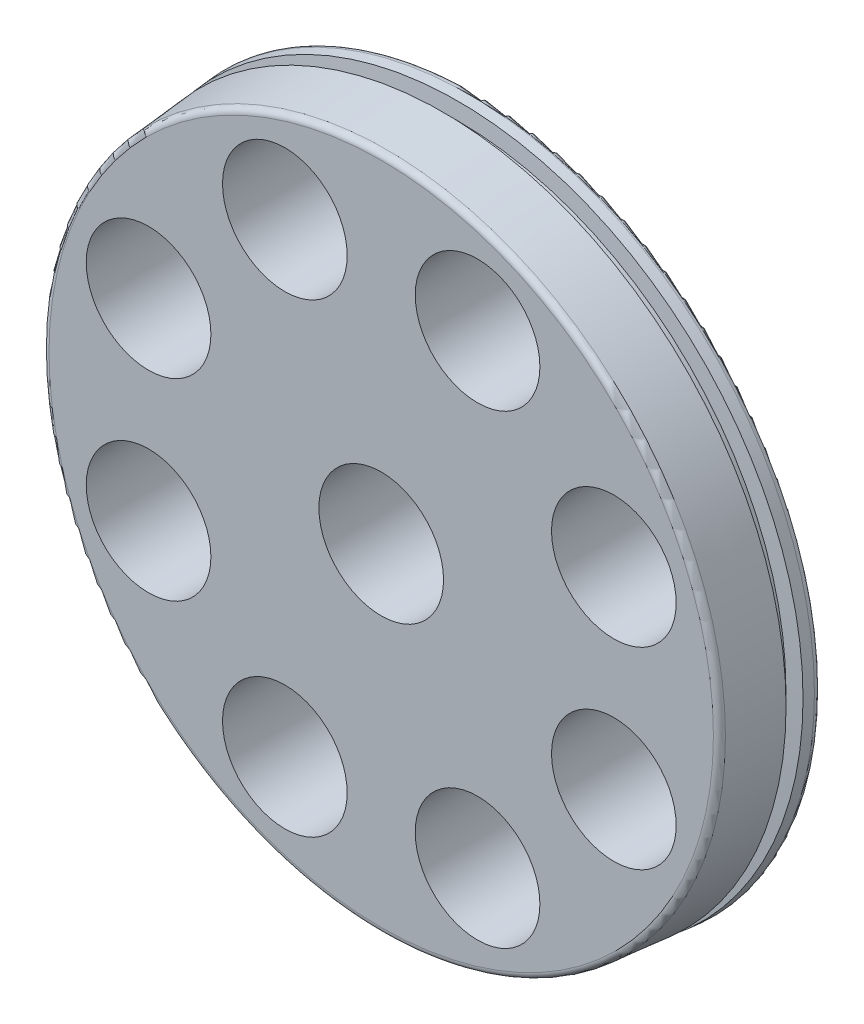
ISO-10303-21;
HEADER;
FILE_DESCRIPTION(('STEP AP214'),'2;1');
FILE_NAME('part.step','',(''),(''),'','','');
FILE_SCHEMA(('AUTOMOTIVE_DESIGN { 1 0 10303 214 1 1 1 1 }'));
ENDSEC;
DATA;
#1=APPLICATION_CONTEXT('core data for automotive mechanical design processes');
#2=APPLICATION_PROTOCOL_DEFINITION('international standard','automotive_design',2000,#1);
#3=PRODUCT_CONTEXT('',#1,'mechanical');
#4=PRODUCT('Part','Part','',(#3));
#5=PRODUCT_RELATED_PRODUCT_CATEGORY('part','',(#4));
#6=PRODUCT_DEFINITION_FORMATION('','',#4);
#7=PRODUCT_DEFINITION_CONTEXT('part definition',#1,'design');
#8=PRODUCT_DEFINITION('design','',#6,#7);
#9=PRODUCT_DEFINITION_SHAPE('','',#8);
#10=(LENGTH_UNIT() NAMED_UNIT(*) SI_UNIT(.MILLI.,.METRE.));
#11=(NAMED_UNIT(*) PLANE_ANGLE_UNIT() SI_UNIT($,.RADIAN.));
#12=(NAMED_UNIT(*) SI_UNIT($,.STERADIAN.) SOLID_ANGLE_UNIT());
#13=UNCERTAINTY_MEASURE_WITH_UNIT(LENGTH_MEASURE(1.E-05),#10,'distance_accuracy_value','');
#14=(GEOMETRIC_REPRESENTATION_CONTEXT(3) GLOBAL_UNCERTAINTY_ASSIGNED_CONTEXT((#13)) GLOBAL_UNIT_ASSIGNED_CONTEXT((#10,
#11,#12)) REPRESENTATION_CONTEXT('',''));
#15=CARTESIAN_POINT('',(0.,0.,0.));
#16=DIRECTION('',(0.,0.,1.));
#17=DIRECTION('',(1.,0.,0.));
#18=AXIS2_PLACEMENT_3D('',#15,#16,#17);
#19=CARTESIAN_POINT('',(0.,0.,0.));
#20=DIRECTION('',(0.,0.,-1.));
#21=DIRECTION('',(1.,0.,0.));
#22=AXIS2_PLACEMENT_3D('',#19,#20,#21);
#23=CONICAL_SURFACE('',#22,69.85,0.0872664625997165);
#24=CARTESIAN_POINT('',(0.,0.,6.64338230790684));
#25=DIRECTION('',(0.,0.,1.));
#26=DIRECTION('',(1.,0.,0.));
#27=AXIS2_PLACEMENT_3D('',#24,#25,#26);
#28=CIRCLE('',#27,69.2687793605895);
#29=CARTESIAN_POINT('',(69.2687793605895,0.,6.64338230790684));
#30=VERTEX_POINT('',#29);
#31=EDGE_CURVE('E46',#30,#30,#28,.T.);
#32=ORIENTED_EDGE('',*,*,#31,.T.);
#33=EDGE_LOOP('',(#32));
#34=FACE_BOUND('',#33,.T.);
#35=CARTESIAN_POINT('',(0.,0.,17.8906877932895));
#36=DIRECTION('',(0.,0.,-1.));
#37=DIRECTION('',(-1.,0.,0.));
#38=AXIS2_PLACEMENT_3D('',#35,#36,#37);
#39=CIRCLE('',#38,68.2847676354055);
#40=CARTESIAN_POINT('',(-68.2847676354055,0.,17.8906877932895));
#41=VERTEX_POINT('',#40);
#42=EDGE_CURVE('E51',#41,#41,#39,.T.);
#43=ORIENTED_EDGE('',*,*,#42,.T.);
#44=EDGE_LOOP('',(#43));
#45=FACE_BOUND('',#44,.T.);
#46=ADVANCED_FACE('F42',(#34,#45),#23,.T.);
#47=CARTESIAN_POINT('',(0.,0.,19.05));
#48=DIRECTION('',(0.,0.,1.));
#49=DIRECTION('',(1.,0.,0.));
#50=AXIS2_PLACEMENT_3D('',#47,#48,#49);
#51=PLANE('',#50);
#52=CARTESIAN_POINT('',(-19.4403183641466,46.9330802515734,19.05));
#53=DIRECTION('',(0.,0.,1.));
#54=DIRECTION('',(1.,0.,0.));
#55=AXIS2_PLACEMENT_3D('',#52,#53,#54);
#56=CIRCLE('',#55,12.573);
#57=CARTESIAN_POINT('',(-6.8673183641466,46.9330802515734,19.05));
#58=VERTEX_POINT('',#57);
#59=EDGE_CURVE('E109',#58,#58,#56,.F.);
#60=ORIENTED_EDGE('',*,*,#59,.T.);
#61=EDGE_LOOP('',(#60));
#62=FACE_BOUND('',#61,.T.);
#63=CARTESIAN_POINT('',(-46.9330802515734,19.4403183641464,19.05));
#64=DIRECTION('',(0.,0.,1.));
#65=DIRECTION('',(1.,0.,0.));
#66=AXIS2_PLACEMENT_3D('',#63,#64,#65);
#67=CIRCLE('',#66,12.573);
#68=CARTESIAN_POINT('',(-34.3600802515734,19.4403183641464,19.05));
#69=VERTEX_POINT('',#68);
#70=EDGE_CURVE('E101',#69,#69,#67,.F.);
#71=ORIENTED_EDGE('',*,*,#70,.T.);
#72=EDGE_LOOP('',(#71));
#73=FACE_BOUND('',#72,.T.);
#74=CARTESIAN_POINT('',(-46.9330802515733,-19.4403183641468,19.05));
#75=DIRECTION('',(0.,0.,1.));
#76=DIRECTION('',(1.,0.,0.));
#77=AXIS2_PLACEMENT_3D('',#74,#75,#76);
#78=CIRCLE('',#77,12.573);
#79=CARTESIAN_POINT('',(-34.3600802515733,-19.4403183641468,19.05));
#80=VERTEX_POINT('',#79);
#81=EDGE_CURVE('E91',#80,#80,#78,.F.);
#82=ORIENTED_EDGE('',*,*,#81,.T.);
#83=EDGE_LOOP('',(#82));
#84=FACE_BOUND('',#83,.T.);
#85=CARTESIAN_POINT('',(-19.4403183641463,-46.9330802515735,19.05));
#86=DIRECTION('',(0.,0.,1.));
#87=DIRECTION('',(1.,0.,0.));
#88=AXIS2_PLACEMENT_3D('',#85,#86,#87);
#89=CIRCLE('',#88,12.573);
#90=CARTESIAN_POINT('',(-6.86731836414629,-46.9330802515735,19.05));
#91=VERTEX_POINT('',#90);
#92=EDGE_CURVE('E92',#91,#91,#89,.F.);
#93=ORIENTED_EDGE('',*,*,#92,.T.);
#94=EDGE_LOOP('',(#93));
#95=FACE_BOUND('',#94,.T.);
#96=CARTESIAN_POINT('',(0.,0.,19.05));
#97=DIRECTION('',(0.,0.,1.));
#98=DIRECTION('',(1.,0.,0.));
#99=AXIS2_PLACEMENT_3D('',#96,#97,#98);
#100=CIRCLE('',#99,12.573);
#101=CARTESIAN_POINT('',(12.573,0.,19.05));
#102=VERTEX_POINT('',#101);
#103=EDGE_CURVE('E140',#102,#102,#100,.F.);
#104=ORIENTED_EDGE('',*,*,#103,.T.);
#105=EDGE_LOOP('',(#104));
#106=FACE_BOUND('',#105,.T.);
#107=CARTESIAN_POINT('',(46.9330802515732,19.4403183641471,19.05));
#108=DIRECTION('',(0.,0.,1.));
#109=DIRECTION('',(1.,0.,0.));
#110=AXIS2_PLACEMENT_3D('',#107,#108,#109);
#111=CIRCLE('',#110,12.573);
#112=CARTESIAN_POINT('',(59.5060802515731,19.4403183641471,19.05));
#113=VERTEX_POINT('',#112);
#114=EDGE_CURVE('E139',#113,#113,#111,.F.);
#115=ORIENTED_EDGE('',*,*,#114,.T.);
#116=EDGE_LOOP('',(#115));
#117=FACE_BOUND('',#116,.T.);
#118=CARTESIAN_POINT('',(46.9330802515735,-19.4403183641461,19.05));
#119=DIRECTION('',(0.,0.,1.));
#120=DIRECTION('',(1.,0.,0.));
#121=AXIS2_PLACEMENT_3D('',#118,#119,#120);
#122=CIRCLE('',#121,12.573);
#123=CARTESIAN_POINT('',(59.5060802515735,-19.4403183641461,19.05));
#124=VERTEX_POINT('',#123);
#125=EDGE_CURVE('E124',#124,#124,#122,.F.);
#126=ORIENTED_EDGE('',*,*,#125,.T.);
#127=EDGE_LOOP('',(#126));
#128=FACE_BOUND('',#127,.T.);
#129=CARTESIAN_POINT('',(19.4403183641469,-46.9330802515732,19.05));
#130=DIRECTION('',(0.,0.,1.));
#131=DIRECTION('',(1.,0.,0.));
#132=AXIS2_PLACEMENT_3D('',#129,#130,#131);
#133=CIRCLE('',#132,12.573);
#134=CARTESIAN_POINT('',(32.0133183641469,-46.9330802515732,19.05));
#135=VERTEX_POINT('',#134);
#136=EDGE_CURVE('E123',#135,#135,#133,.F.);
#137=ORIENTED_EDGE('',*,*,#136,.T.);
#138=EDGE_LOOP('',(#137));
#139=FACE_BOUND('',#138,.T.);
#140=CARTESIAN_POINT('',(19.440318364146,46.9330802515736,19.05));
#141=DIRECTION('',(0.,0.,1.));
#142=DIRECTION('',(1.,0.,0.));
#143=AXIS2_PLACEMENT_3D('',#140,#141,#142);
#144=CIRCLE('',#143,12.573);
#145=CARTESIAN_POINT('',(32.013318364146,46.9330802515736,19.05));
#146=VERTEX_POINT('',#145);
#147=EDGE_CURVE('E78',#146,#146,#144,.F.);
#148=ORIENTED_EDGE('',*,*,#147,.T.);
#149=EDGE_LOOP('',(#148));
#150=FACE_BOUND('',#149,.T.);
#151=CARTESIAN_POINT('',(0.,0.,19.05));
#152=DIRECTION('',(0.,0.,1.));
#153=DIRECTION('',(1.,0.,0.));
#154=AXIS2_PLACEMENT_3D('',#151,#152,#153);
#155=CIRCLE('',#154,67.019600368829);
#156=CARTESIAN_POINT('',(67.019600368829,0.,19.05));
#157=VERTEX_POINT('',#156);
#158=EDGE_CURVE('E62',#157,#157,#155,.T.);
#159=ORIENTED_EDGE('',*,*,#158,.T.);
#160=EDGE_LOOP('',(#159));
#161=FACE_BOUND('',#160,.T.);
#162=ADVANCED_FACE('F151',(#62,#73,#84,#95,#106,#117,#128,#139,#150,#161),#51,.T.);
#163=CARTESIAN_POINT('',(0.,0.,17.78));
#164=DIRECTION('',(0.,0.,1.));
#165=DIRECTION('',(1.,0.,0.));
#166=AXIS2_PLACEMENT_3D('',#163,#164,#165);
#167=TOROIDAL_SURFACE('',#166,67.019600368829,1.27);
#168=ORIENTED_EDGE('',*,*,#42,.F.);
#169=EDGE_LOOP('',(#168));
#170=FACE_BOUND('',#169,.T.);
#171=ORIENTED_EDGE('',*,*,#158,.F.);
#172=EDGE_LOOP('',(#171));
#173=FACE_BOUND('',#172,.T.);
#174=ADVANCED_FACE('F177',(#170,#173),#167,.T.);
#175=CARTESIAN_POINT('',(0.,0.,6.6675));
#176=DIRECTION('',(0.,0.,1.));
#177=DIRECTION('',(1.,0.,0.));
#178=AXIS2_PLACEMENT_3D('',#175,#176,#177);
#179=CONICAL_SURFACE('',#178,69.5444458426357,1.48352986419518);
#180=CARTESIAN_POINT('',(0.,0.,6.38972349330518));
#181=DIRECTION('',(0.,0.,-1.));
#182=DIRECTION('',(-1.,0.,0.));
#183=AXIS2_PLACEMENT_3D('',#180,#181,#182);
#184=CIRCLE('',#183,66.3694458426357);
#185=CARTESIAN_POINT('',(-66.3694458426357,0.,6.38972349330518));
#186=VERTEX_POINT('',#185);
#187=EDGE_CURVE('E70',#186,#186,#184,.T.);
#188=ORIENTED_EDGE('',*,*,#187,.F.);
#189=EDGE_LOOP('',(#188));
#190=FACE_BOUND('',#189,.T.);
#191=ORIENTED_EDGE('',*,*,#31,.F.);
#192=EDGE_LOOP('',(#191));
#193=FACE_BOUND('',#192,.T.);
#194=ADVANCED_FACE('F203',(#190,#193),#179,.T.);
#195=CARTESIAN_POINT('',(0.,0.,3.77027650669482));
#196=DIRECTION('',(0.,0.,-1.));
#197=DIRECTION('',(-1.,0.,0.));
#198=AXIS2_PLACEMENT_3D('',#195,#196,#197);
#199=CONICAL_SURFACE('',#198,66.3694458426357,1.48352986419518);
#200=CARTESIAN_POINT('',(0.,0.,3.4925));
#201=DIRECTION('',(0.,0.,-1.));
#202=DIRECTION('',(-1.,0.,0.));
#203=AXIS2_PLACEMENT_3D('',#200,#201,#202);
#204=CIRCLE('',#203,69.5444458426357);
#205=CARTESIAN_POINT('',(-69.5444458426357,0.,3.4925));
#206=VERTEX_POINT('',#205);
#207=EDGE_CURVE('E74',#206,#206,#204,.T.);
#208=ORIENTED_EDGE('',*,*,#207,.F.);
#209=EDGE_LOOP('',(#208));
#210=FACE_BOUND('',#209,.T.);
#211=CARTESIAN_POINT('',(0.,0.,3.77027650669482));
#212=DIRECTION('',(0.,0.,-1.));
#213=DIRECTION('',(-1.,0.,0.));
#214=AXIS2_PLACEMENT_3D('',#211,#212,#213);
#215=CIRCLE('',#214,66.3694458426357);
#216=CARTESIAN_POINT('',(-66.3694458426357,0.,3.77027650669482));
#217=VERTEX_POINT('',#216);
#218=EDGE_CURVE('E66',#217,#217,#215,.T.);
#219=ORIENTED_EDGE('',*,*,#218,.T.);
#220=EDGE_LOOP('',(#219));
#221=FACE_BOUND('',#220,.T.);
#222=ADVANCED_FACE('F199',(#210,#221),#199,.T.);
#223=CARTESIAN_POINT('',(0.,0.,0.));
#224=DIRECTION('',(0.,0.,-1.));
#225=DIRECTION('',(-1.,0.,0.));
#226=AXIS2_PLACEMENT_3D('',#223,#224,#225);
#227=CYLINDRICAL_SURFACE('',#226,66.3694458426357);
#228=ORIENTED_EDGE('',*,*,#218,.F.);
#229=EDGE_LOOP('',(#228));
#230=FACE_BOUND('',#229,.T.);
#231=ORIENTED_EDGE('',*,*,#187,.T.);
#232=EDGE_LOOP('',(#231));
#233=FACE_BOUND('',#232,.T.);
#234=ADVANCED_FACE('F202',(#230,#233),#227,.T.);
#235=CARTESIAN_POINT('',(0.,0.,0.));
#236=DIRECTION('',(0.,0.,1.));
#237=DIRECTION('',(1.,0.,0.));
#238=AXIS2_PLACEMENT_3D('',#235,#236,#237);
#239=PLANE('',#238);
#240=CARTESIAN_POINT('',(-19.4403183641466,46.9330802515734,0.));
#241=DIRECTION('',(0.,0.,-1.));
#242=DIRECTION('',(-1.,0.,0.));
#243=AXIS2_PLACEMENT_3D('',#240,#241,#242);
#244=CIRCLE('',#243,12.573);
#245=CARTESIAN_POINT('',(-32.0133183641466,46.9330802515734,0.));
#246=VERTEX_POINT('',#245);
#247=EDGE_CURVE('E86',#246,#246,#244,.T.);
#248=ORIENTED_EDGE('',*,*,#247,.F.);
#249=EDGE_LOOP('',(#248));
#250=FACE_BOUND('',#249,.T.);
#251=CARTESIAN_POINT('',(-46.9330802515734,19.4403183641464,0.));
#252=DIRECTION('',(0.,0.,-1.));
#253=DIRECTION('',(-1.,0.,0.));
#254=AXIS2_PLACEMENT_3D('',#251,#252,#253);
#255=CIRCLE('',#254,12.573);
#256=CARTESIAN_POINT('',(-59.5060802515734,19.4403183641464,0.));
#257=VERTEX_POINT('',#256);
#258=EDGE_CURVE('E105',#257,#257,#255,.T.);
#259=ORIENTED_EDGE('',*,*,#258,.F.);
#260=EDGE_LOOP('',(#259));
#261=FACE_BOUND('',#260,.T.);
#262=CARTESIAN_POINT('',(-46.9330802515733,-19.4403183641468,0.));
#263=DIRECTION('',(0.,0.,-1.));
#264=DIRECTION('',(-1.,0.,0.));
#265=AXIS2_PLACEMENT_3D('',#262,#263,#264);
#266=CIRCLE('',#265,12.573);
#267=CARTESIAN_POINT('',(-59.5060802515733,-19.4403183641468,0.));
#268=VERTEX_POINT('',#267);
#269=EDGE_CURVE('E97',#268,#268,#266,.T.);
#270=ORIENTED_EDGE('',*,*,#269,.F.);
#271=EDGE_LOOP('',(#270));
#272=FACE_BOUND('',#271,.T.);
#273=CARTESIAN_POINT('',(-19.4403183641463,-46.9330802515735,0.));
#274=DIRECTION('',(0.,0.,-1.));
#275=DIRECTION('',(-1.,0.,0.));
#276=AXIS2_PLACEMENT_3D('',#273,#274,#275);
#277=CIRCLE('',#276,12.573);
#278=CARTESIAN_POINT('',(-32.0133183641463,-46.9330802515735,0.));
#279=VERTEX_POINT('',#278);
#280=EDGE_CURVE('E87',#279,#279,#277,.T.);
#281=ORIENTED_EDGE('',*,*,#280,.F.);
#282=EDGE_LOOP('',(#281));
#283=FACE_BOUND('',#282,.T.);
#284=CARTESIAN_POINT('',(0.,0.,0.));
#285=DIRECTION('',(0.,0.,-1.));
#286=DIRECTION('',(-1.,0.,0.));
#287=AXIS2_PLACEMENT_3D('',#284,#285,#286);
#288=CIRCLE('',#287,12.573);
#289=CARTESIAN_POINT('',(-12.573,0.,0.));
#290=VERTEX_POINT('',#289);
#291=EDGE_CURVE('E135',#290,#290,#288,.T.);
#292=ORIENTED_EDGE('',*,*,#291,.F.);
#293=EDGE_LOOP('',(#292));
#294=FACE_BOUND('',#293,.T.);
#295=CARTESIAN_POINT('',(46.9330802515732,19.4403183641471,0.));
#296=DIRECTION('',(0.,0.,-1.));
#297=DIRECTION('',(-1.,0.,0.));
#298=AXIS2_PLACEMENT_3D('',#295,#296,#297);
#299=CIRCLE('',#298,12.573);
#300=CARTESIAN_POINT('',(34.3600802515732,19.4403183641471,0.));
#301=VERTEX_POINT('',#300);
#302=EDGE_CURVE('E128',#301,#301,#299,.T.);
#303=ORIENTED_EDGE('',*,*,#302,.F.);
#304=EDGE_LOOP('',(#303));
#305=FACE_BOUND('',#304,.T.);
#306=CARTESIAN_POINT('',(46.9330802515735,-19.4403183641461,0.));
#307=DIRECTION('',(0.,0.,-1.));
#308=DIRECTION('',(-1.,0.,0.));
#309=AXIS2_PLACEMENT_3D('',#306,#307,#308);
#310=CIRCLE('',#309,12.573);
#311=CARTESIAN_POINT('',(34.3600802515735,-19.4403183641461,0.));
#312=VERTEX_POINT('',#311);
#313=EDGE_CURVE('E119',#312,#312,#310,.T.);
#314=ORIENTED_EDGE('',*,*,#313,.F.);
#315=EDGE_LOOP('',(#314));
#316=FACE_BOUND('',#315,.T.);
#317=CARTESIAN_POINT('',(19.4403183641469,-46.9330802515732,0.));
#318=DIRECTION('',(0.,0.,-1.));
#319=DIRECTION('',(-1.,0.,0.));
#320=AXIS2_PLACEMENT_3D('',#317,#318,#319);
#321=CIRCLE('',#320,12.573);
#322=CARTESIAN_POINT('',(6.86731836414692,-46.9330802515732,0.));
#323=VERTEX_POINT('',#322);
#324=EDGE_CURVE('E96',#323,#323,#321,.T.);
#325=ORIENTED_EDGE('',*,*,#324,.F.);
#326=EDGE_LOOP('',(#325));
#327=FACE_BOUND('',#326,.T.);
#328=CARTESIAN_POINT('',(19.440318364146,46.9330802515736,0.));
#329=DIRECTION('',(0.,0.,-1.));
#330=DIRECTION('',(-1.,0.,0.));
#331=AXIS2_PLACEMENT_3D('',#328,#329,#330);
#332=CIRCLE('',#331,12.573);
#333=CARTESIAN_POINT('',(6.86731836414596,46.9330802515736,0.));
#334=VERTEX_POINT('',#333);
#335=EDGE_CURVE('E82',#334,#334,#332,.T.);
#336=ORIENTED_EDGE('',*,*,#335,.F.);
#337=EDGE_LOOP('',(#336));
#338=FACE_BOUND('',#337,.T.);
#339=CARTESIAN_POINT('',(0.,0.,0.));
#340=DIRECTION('',(0.,0.,1.));
#341=DIRECTION('',(1.,0.,0.));
#342=AXIS2_PLACEMENT_3D('',#339,#340,#341);
#343=CIRCLE('',#342,68.464038203642);
#344=CARTESIAN_POINT('',(68.464038203642,0.,0.));
#345=VERTEX_POINT('',#344);
#346=EDGE_CURVE('E10',#345,#345,#343,.F.);
#347=ORIENTED_EDGE('',*,*,#346,.T.);
#348=EDGE_LOOP('',(#347));
#349=FACE_BOUND('',#348,.T.);
#350=ADVANCED_FACE('F192',(#250,#261,#272,#283,#294,#305,#316,#327,#338,#349),#239,.F.);
#351=CARTESIAN_POINT('',(0.,0.,1.27));
#352=DIRECTION('',(0.,0.,1.));
#353=DIRECTION('',(1.,0.,0.));
#354=AXIS2_PLACEMENT_3D('',#351,#352,#353);
#355=TOROIDAL_SURFACE('',#354,68.464038203642,1.27);
#356=ORIENTED_EDGE('',*,*,#346,.F.);
#357=EDGE_LOOP('',(#356));
#358=FACE_BOUND('',#357,.T.);
#359=CARTESIAN_POINT('',(0.,0.,1.38068779328948));
#360=DIRECTION('',(0.,0.,1.));
#361=DIRECTION('',(1.,0.,0.));
#362=AXIS2_PLACEMENT_3D('',#359,#360,#361);
#363=CIRCLE('',#362,69.7292054702185);
#364=CARTESIAN_POINT('',(69.7292054702185,0.,1.38068779328948));
#365=VERTEX_POINT('',#364);
#366=EDGE_CURVE('E56',#365,#365,#363,.T.);
#367=ORIENTED_EDGE('',*,*,#366,.F.);
#368=EDGE_LOOP('',(#367));
#369=FACE_BOUND('',#368,.T.);
#370=ADVANCED_FACE('F44',(#358,#369),#355,.T.);
#371=ORIENTED_EDGE('',*,*,#207,.T.);
#372=EDGE_LOOP('',(#371));
#373=FACE_BOUND('',#372,.T.);
#374=ORIENTED_EDGE('',*,*,#366,.T.);
#375=EDGE_LOOP('',(#374));
#376=FACE_BOUND('',#375,.T.);
#377=ADVANCED_FACE('F173',(#373,#376),#23,.T.);
#378=CARTESIAN_POINT('',(19.440318364146,46.9330802515736,54.6118142394339));
#379=DIRECTION('',(0.,0.,-1.));
#380=DIRECTION('',(-1.,0.,0.));
#381=AXIS2_PLACEMENT_3D('',#378,#379,#380);
#382=CYLINDRICAL_SURFACE('',#381,12.573);
#383=ORIENTED_EDGE('',*,*,#335,.T.);
#384=EDGE_LOOP('',(#383));
#385=FACE_BOUND('',#384,.T.);
#386=ORIENTED_EDGE('',*,*,#147,.F.);
#387=EDGE_LOOP('',(#386));
#388=FACE_BOUND('',#387,.T.);
#389=ADVANCED_FACE('F184',(#385,#388),#382,.F.);
#390=CARTESIAN_POINT('',(19.4403183641469,-46.9330802515732,54.6118142394339));
#391=DIRECTION('',(0.,0.,-1.));
#392=DIRECTION('',(-1.,0.,0.));
#393=AXIS2_PLACEMENT_3D('',#390,#391,#392);
#394=CYLINDRICAL_SURFACE('',#393,12.573);
#395=ORIENTED_EDGE('',*,*,#324,.T.);
#396=EDGE_LOOP('',(#395));
#397=FACE_BOUND('',#396,.T.);
#398=ORIENTED_EDGE('',*,*,#136,.F.);
#399=EDGE_LOOP('',(#398));
#400=FACE_BOUND('',#399,.T.);
#401=ADVANCED_FACE('F167',(#397,#400),#394,.F.);
#402=CARTESIAN_POINT('',(46.9330802515735,-19.4403183641461,54.6118142394339));
#403=DIRECTION('',(0.,0.,-1.));
#404=DIRECTION('',(-1.,0.,0.));
#405=AXIS2_PLACEMENT_3D('',#402,#403,#404);
#406=CYLINDRICAL_SURFACE('',#405,12.573);
#407=ORIENTED_EDGE('',*,*,#313,.T.);
#408=EDGE_LOOP('',(#407));
#409=FACE_BOUND('',#408,.T.);
#410=ORIENTED_EDGE('',*,*,#125,.F.);
#411=EDGE_LOOP('',(#410));
#412=FACE_BOUND('',#411,.T.);
#413=ADVANCED_FACE('F157',(#409,#412),#406,.F.);
#414=CARTESIAN_POINT('',(46.9330802515732,19.4403183641471,54.6118142394339));
#415=DIRECTION('',(0.,0.,-1.));
#416=DIRECTION('',(-1.,0.,0.));
#417=AXIS2_PLACEMENT_3D('',#414,#415,#416);
#418=CYLINDRICAL_SURFACE('',#417,12.573);
#419=ORIENTED_EDGE('',*,*,#302,.T.);
#420=EDGE_LOOP('',(#419));
#421=FACE_BOUND('',#420,.T.);
#422=ORIENTED_EDGE('',*,*,#114,.F.);
#423=EDGE_LOOP('',(#422));
#424=FACE_BOUND('',#423,.T.);
#425=ADVANCED_FACE('F154',(#421,#424),#418,.F.);
#426=CARTESIAN_POINT('',(0.,0.,54.6118142394339));
#427=DIRECTION('',(0.,0.,-1.));
#428=DIRECTION('',(-1.,0.,0.));
#429=AXIS2_PLACEMENT_3D('',#426,#427,#428);
#430=CYLINDRICAL_SURFACE('',#429,12.573);
#431=ORIENTED_EDGE('',*,*,#291,.T.);
#432=EDGE_LOOP('',(#431));
#433=FACE_BOUND('',#432,.T.);
#434=ORIENTED_EDGE('',*,*,#103,.F.);
#435=EDGE_LOOP('',(#434));
#436=FACE_BOUND('',#435,.T.);
#437=ADVANCED_FACE('F156',(#433,#436),#430,.F.);
#438=CARTESIAN_POINT('',(-19.4403183641463,-46.9330802515735,54.6118142394339));
#439=DIRECTION('',(0.,0.,-1.));
#440=DIRECTION('',(-1.,0.,0.));
#441=AXIS2_PLACEMENT_3D('',#438,#439,#440);
#442=CYLINDRICAL_SURFACE('',#441,12.573);
#443=ORIENTED_EDGE('',*,*,#280,.T.);
#444=EDGE_LOOP('',(#443));
#445=FACE_BOUND('',#444,.T.);
#446=ORIENTED_EDGE('',*,*,#92,.F.);
#447=EDGE_LOOP('',(#446));
#448=FACE_BOUND('',#447,.T.);
#449=ADVANCED_FACE('F164',(#445,#448),#442,.F.);
#450=CARTESIAN_POINT('',(-46.9330802515733,-19.4403183641468,54.6118142394339));
#451=DIRECTION('',(0.,0.,-1.));
#452=DIRECTION('',(-1.,0.,0.));
#453=AXIS2_PLACEMENT_3D('',#450,#451,#452);
#454=CYLINDRICAL_SURFACE('',#453,12.573);
#455=ORIENTED_EDGE('',*,*,#269,.T.);
#456=EDGE_LOOP('',(#455));
#457=FACE_BOUND('',#456,.T.);
#458=ORIENTED_EDGE('',*,*,#81,.F.);
#459=EDGE_LOOP('',(#458));
#460=FACE_BOUND('',#459,.T.);
#461=ADVANCED_FACE('F265',(#457,#460),#454,.F.);
#462=CARTESIAN_POINT('',(-46.9330802515734,19.4403183641464,54.6118142394339));
#463=DIRECTION('',(0.,0.,-1.));
#464=DIRECTION('',(-1.,0.,0.));
#465=AXIS2_PLACEMENT_3D('',#462,#463,#464);
#466=CYLINDRICAL_SURFACE('',#465,12.573);
#467=ORIENTED_EDGE('',*,*,#258,.T.);
#468=EDGE_LOOP('',(#467));
#469=FACE_BOUND('',#468,.T.);
#470=ORIENTED_EDGE('',*,*,#70,.F.);
#471=EDGE_LOOP('',(#470));
#472=FACE_BOUND('',#471,.T.);
#473=ADVANCED_FACE('F261',(#469,#472),#466,.F.);
#474=CARTESIAN_POINT('',(-19.4403183641466,46.9330802515734,54.6118142394339));
#475=DIRECTION('',(0.,0.,-1.));
#476=DIRECTION('',(-1.,0.,0.));
#477=AXIS2_PLACEMENT_3D('',#474,#475,#476);
#478=CYLINDRICAL_SURFACE('',#477,12.573);
#479=ORIENTED_EDGE('',*,*,#247,.T.);
#480=EDGE_LOOP('',(#479));
#481=FACE_BOUND('',#480,.T.);
#482=ORIENTED_EDGE('',*,*,#59,.F.);
#483=EDGE_LOOP('',(#482));
#484=FACE_BOUND('',#483,.T.);
#485=ADVANCED_FACE('F258',(#481,#484),#478,.F.);
#486=CLOSED_SHELL('',(#46,#162,#174,#194,#222,#234,#350,#370,#377,#389,#401,#413,#425,#437,#449,
#461,#473,#485));
#487=MANIFOLD_SOLID_BREP('B2',#486);
#488=ADVANCED_BREP_SHAPE_REPRESENTATION('',(#18,#487),#14);
#489=SHAPE_DEFINITION_REPRESENTATION(#9,#488);
ENDSEC;
END-ISO-10303-21;
